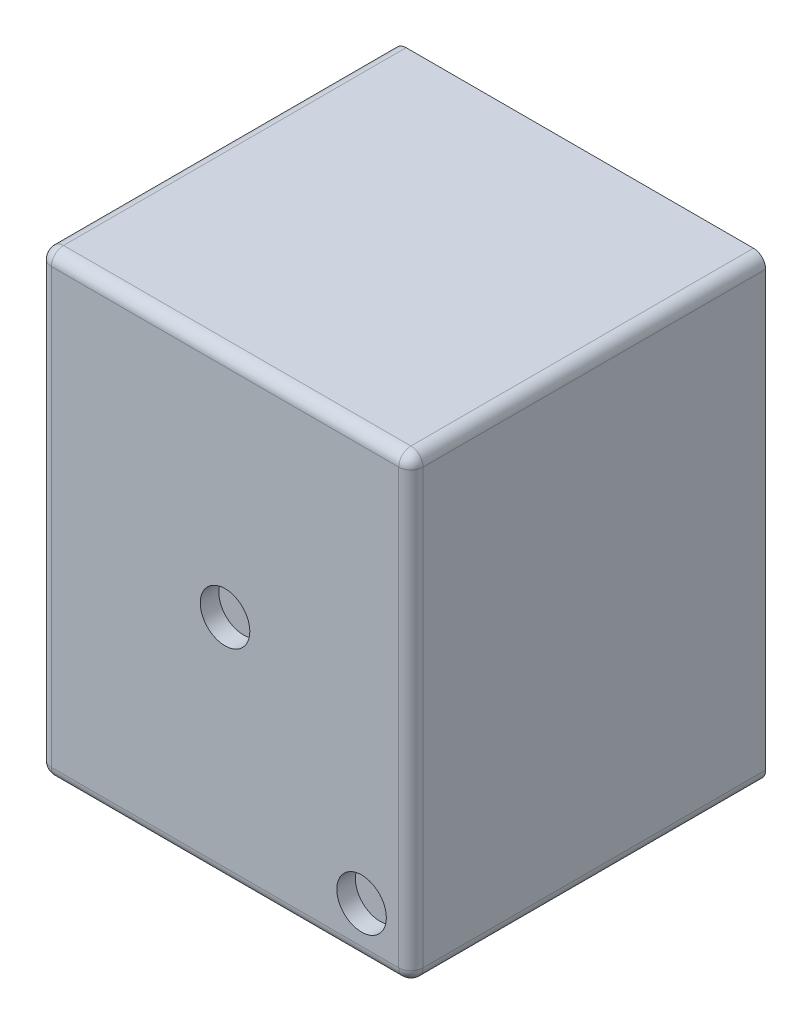
ISO-10303-21;
HEADER;
FILE_DESCRIPTION(('STEP AP214'),'2;1');
FILE_NAME('part.step','',(''),(''),'','','');
FILE_SCHEMA(('AUTOMOTIVE_DESIGN { 1 0 10303 214 1 1 1 1 }'));
ENDSEC;
DATA;
#1=APPLICATION_CONTEXT('core data for automotive mechanical design processes');
#2=APPLICATION_PROTOCOL_DEFINITION('international standard','automotive_design',2000,#1);
#3=PRODUCT_CONTEXT('',#1,'mechanical');
#4=PRODUCT('Part','Part','',(#3));
#5=PRODUCT_RELATED_PRODUCT_CATEGORY('part','',(#4));
#6=PRODUCT_DEFINITION_FORMATION('','',#4);
#7=PRODUCT_DEFINITION_CONTEXT('part definition',#1,'design');
#8=PRODUCT_DEFINITION('design','',#6,#7);
#9=PRODUCT_DEFINITION_SHAPE('','',#8);
#10=(LENGTH_UNIT() NAMED_UNIT(*) SI_UNIT(.MILLI.,.METRE.));
#11=(NAMED_UNIT(*) PLANE_ANGLE_UNIT() SI_UNIT($,.RADIAN.));
#12=(NAMED_UNIT(*) SI_UNIT($,.STERADIAN.) SOLID_ANGLE_UNIT());
#13=UNCERTAINTY_MEASURE_WITH_UNIT(LENGTH_MEASURE(1.E-05),#10,'distance_accuracy_value','');
#14=(GEOMETRIC_REPRESENTATION_CONTEXT(3) GLOBAL_UNCERTAINTY_ASSIGNED_CONTEXT((#13)) GLOBAL_UNIT_ASSIGNED_CONTEXT((#10,
#11,#12)) REPRESENTATION_CONTEXT('',''));
#15=CARTESIAN_POINT('',(0.,0.,0.));
#16=DIRECTION('',(0.,0.,1.));
#17=DIRECTION('',(1.,0.,0.));
#18=AXIS2_PLACEMENT_3D('',#15,#16,#17);
#19=CARTESIAN_POINT('',(-0.322364285309383,0.168780356945077,0.617807641667743));
#20=DIRECTION('',(0.,0.,1.));
#21=DIRECTION('',(1.,0.,0.));
#22=AXIS2_PLACEMENT_3D('',#19,#20,#21);
#23=PLANE('',#22);
#24=CARTESIAN_POINT('',(-0.322364285309383,0.168780356945077,0.617807641667743));
#25=DIRECTION('',(0.,0.,1.));
#26=DIRECTION('',(1.,0.,0.));
#27=AXIS2_PLACEMENT_3D('',#24,#25,#26);
#28=CIRCLE('',#27,0.04);
#29=CARTESIAN_POINT('',(-0.282364285309383,0.168780356945077,0.617807641667743));
#30=VERTEX_POINT('',#29);
#31=EDGE_CURVE('E20',#30,#30,#28,.T.);
#32=ORIENTED_EDGE('',*,*,#31,.T.);
#33=EDGE_LOOP('',(#32));
#34=FACE_BOUND('',#33,.T.);
#35=ADVANCED_FACE('F17',(#34),#23,.T.);
#36=CARTESIAN_POINT('',(-0.101920242454084,-0.121368087614107,0.617807641667743));
#37=DIRECTION('',(0.,0.,1.));
#38=DIRECTION('',(1.,0.,0.));
#39=AXIS2_PLACEMENT_3D('',#36,#37,#38);
#40=PLANE('',#39);
#41=CARTESIAN_POINT('',(-0.101920242454084,-0.121368087614107,0.617807641667743));
#42=DIRECTION('',(0.,0.,1.));
#43=DIRECTION('',(1.,0.,0.));
#44=AXIS2_PLACEMENT_3D('',#41,#42,#43);
#45=CIRCLE('',#44,0.04);
#46=CARTESIAN_POINT('',(-0.061920242454084,-0.121368087614107,0.617807641667743));
#47=VERTEX_POINT('',#46);
#48=EDGE_CURVE('E175',#47,#47,#45,.T.);
#49=ORIENTED_EDGE('',*,*,#48,.T.);
#50=EDGE_LOOP('',(#49));
#51=FACE_BOUND('',#50,.T.);
#52=ADVANCED_FACE('F187',(#51),#40,.T.);
#53=CARTESIAN_POINT('',(-0.322364285309383,0.168780356945077,0.647807641667743));
#54=DIRECTION('',(0.,0.,1.));
#55=DIRECTION('',(1.,0.,0.));
#56=AXIS2_PLACEMENT_3D('',#53,#54,#55);
#57=CYLINDRICAL_SURFACE('',#56,0.04);
#58=ORIENTED_EDGE('',*,*,#31,.F.);
#59=EDGE_LOOP('',(#58));
#60=FACE_BOUND('',#59,.T.);
#61=CARTESIAN_POINT('',(-0.322364285309383,0.168780356945077,0.647807641667743));
#62=DIRECTION('',(0.,0.,1.));
#63=DIRECTION('',(1.,0.,0.));
#64=AXIS2_PLACEMENT_3D('',#61,#62,#63);
#65=CIRCLE('',#64,0.04);
#66=CARTESIAN_POINT('',(-0.282364285309383,0.168780356945077,0.647807641667743));
#67=VERTEX_POINT('',#66);
#68=EDGE_CURVE('E173',#67,#67,#65,.T.);
#69=ORIENTED_EDGE('',*,*,#68,.T.);
#70=EDGE_LOOP('',(#69));
#71=FACE_BOUND('',#70,.T.);
#72=ADVANCED_FACE('F183',(#60,#71),#57,.F.);
#73=CARTESIAN_POINT('',(-0.101920242454084,-0.121368087614107,0.647807641667743));
#74=DIRECTION('',(0.,0.,1.));
#75=DIRECTION('',(1.,0.,0.));
#76=AXIS2_PLACEMENT_3D('',#73,#74,#75);
#77=CYLINDRICAL_SURFACE('',#76,0.04);
#78=ORIENTED_EDGE('',*,*,#48,.F.);
#79=EDGE_LOOP('',(#78));
#80=FACE_BOUND('',#79,.T.);
#81=CARTESIAN_POINT('',(-0.101920242454084,-0.121368087614107,0.647807641667743));
#82=DIRECTION('',(0.,0.,1.));
#83=DIRECTION('',(1.,0.,0.));
#84=AXIS2_PLACEMENT_3D('',#81,#82,#83);
#85=CIRCLE('',#84,0.04);
#86=CARTESIAN_POINT('',(-0.061920242454084,-0.121368087614107,0.647807641667743));
#87=VERTEX_POINT('',#86);
#88=EDGE_CURVE('E139',#87,#87,#85,.T.);
#89=ORIENTED_EDGE('',*,*,#88,.T.);
#90=EDGE_LOOP('',(#89));
#91=FACE_BOUND('',#90,.T.);
#92=ADVANCED_FACE('F186',(#80,#91),#77,.F.);
#93=CARTESIAN_POINT('',(-0.630852732450211,0.55394364596018,0.647807641667743));
#94=DIRECTION('',(0.,0.,-1.));
#95=DIRECTION('',(-1.,0.,0.));
#96=AXIS2_PLACEMENT_3D('',#93,#94,#95);
#97=PLANE('',#96);
#98=DIRECTION('',(0.,-1.,0.));
#99=VECTOR('',#98,1.);
#100=CARTESIAN_POINT('',(-0.041920242454084,-0.216382932070025,0.647807641667743));
#101=LINE('',#100,#99);
#102=CARTESIAN_POINT('',(-0.0419202424540837,0.518928801504261,0.647807641667743));
#103=VERTEX_POINT('',#102);
#104=CARTESIAN_POINT('',(-0.0419202424540841,-0.181368087614107,0.647807641667743));
#105=VERTEX_POINT('',#104);
#106=EDGE_CURVE('E132',#103,#105,#101,.T.);
#107=ORIENTED_EDGE('',*,*,#106,.F.);
#108=DIRECTION('',(1.,0.,0.));
#109=VECTOR('',#108,1.);
#110=CARTESIAN_POINT('',(-0.0138758381685538,0.518928801504262,0.647807641667743));
#111=LINE('',#110,#109);
#112=CARTESIAN_POINT('',(-0.602808328164682,0.518928801504262,0.647807641667743));
#113=VERTEX_POINT('',#112);
#114=EDGE_CURVE('E126',#113,#103,#111,.T.);
#115=ORIENTED_EDGE('',*,*,#114,.F.);
#116=DIRECTION('',(0.,1.,0.));
#117=VECTOR('',#116,1.);
#118=CARTESIAN_POINT('',(-0.602808328164682,0.55394364596018,0.647807641667743));
#119=LINE('',#118,#117);
#120=CARTESIAN_POINT('',(-0.602808328164682,-0.181368087614107,0.647807641667743));
#121=VERTEX_POINT('',#120);
#122=EDGE_CURVE('E155',#121,#113,#119,.T.);
#123=ORIENTED_EDGE('',*,*,#122,.F.);
#124=DIRECTION('',(-1.,0.,0.));
#125=VECTOR('',#124,1.);
#126=CARTESIAN_POINT('',(-0.630852732450212,-0.181368087614107,0.647807641667743));
#127=LINE('',#126,#125);
#128=EDGE_CURVE('E131',#105,#121,#127,.T.);
#129=ORIENTED_EDGE('',*,*,#128,.F.);
#130=EDGE_LOOP('',(#107,#115,#123,#129));
#131=FACE_BOUND('',#130,.T.);
#132=ORIENTED_EDGE('',*,*,#88,.F.);
#133=EDGE_LOOP('',(#132));
#134=FACE_BOUND('',#133,.T.);
#135=ORIENTED_EDGE('',*,*,#68,.F.);
#136=EDGE_LOOP('',(#135));
#137=FACE_BOUND('',#136,.T.);
#138=ADVANCED_FACE('F135',(#131,#134,#137),#97,.F.);
#139=CARTESIAN_POINT('',(-0.630852732450212,-0.181368087614107,0.628135510520202));
#140=DIRECTION('',(-1.,0.,0.));
#141=DIRECTION('',(0.,-1.,0.));
#142=AXIS2_PLACEMENT_3D('',#139,#140,#141);
#143=CYLINDRICAL_SURFACE('',#142,0.019672131147541);
#144=DIRECTION('',(1.,0.,0.));
#145=VECTOR('',#144,1.);
#146=CARTESIAN_POINT('',(-0.622480459312222,-0.201040218761648,0.628135510520202));
#147=LINE('',#146,#145);
#148=CARTESIAN_POINT('',(-0.0419202424540841,-0.201040218761648,0.628135510520202));
#149=VERTEX_POINT('',#148);
#150=CARTESIAN_POINT('',(-0.602808328164683,-0.201040218761648,0.628135510520202));
#151=VERTEX_POINT('',#150);
#152=EDGE_CURVE('E293',#149,#151,#147,.F.);
#153=ORIENTED_EDGE('',*,*,#152,.F.);
#154=CARTESIAN_POINT('',(-0.0419202424540841,-0.181368087614107,0.628135510520202));
#155=DIRECTION('',(-1.,0.,0.));
#156=DIRECTION('',(0.,-1.,0.));
#157=AXIS2_PLACEMENT_3D('',#154,#155,#156);
#158=CIRCLE('',#157,0.019672131147541);
#159=EDGE_CURVE('E147',#105,#149,#158,.F.);
#160=ORIENTED_EDGE('',*,*,#159,.F.);
#161=ORIENTED_EDGE('',*,*,#128,.T.);
#162=CARTESIAN_POINT('',(-0.602808328164683,-0.181368087614107,0.628135510520202));
#163=DIRECTION('',(-1.,0.,0.));
#164=DIRECTION('',(0.,-1.,0.));
#165=AXIS2_PLACEMENT_3D('',#162,#163,#164);
#166=CIRCLE('',#165,0.019672131147541);
#167=EDGE_CURVE('E260',#151,#121,#166,.T.);
#168=ORIENTED_EDGE('',*,*,#167,.F.);
#169=EDGE_LOOP('',(#153,#160,#161,#168));
#170=FACE_BOUND('',#169,.T.);
#171=ADVANCED_FACE('F192',(#170),#143,.T.);
#172=CARTESIAN_POINT('',(-0.0419202424540841,-0.181368087614107,0.628135510520202));
#173=DIRECTION('',(0.,-1.,0.));
#174=DIRECTION('',(0.,0.,1.));
#175=AXIS2_PLACEMENT_3D('',#172,#173,#174);
#176=SPHERICAL_SURFACE('',#175,0.019672131147541);
#177=CARTESIAN_POINT('',(-0.0419202424540841,-0.181368087614107,0.628135510520202));
#178=DIRECTION('',(0.,-1.,0.));
#179=DIRECTION('',(1.,0.,0.));
#180=AXIS2_PLACEMENT_3D('',#177,#178,#179);
#181=CIRCLE('',#180,0.019672131147541);
#182=CARTESIAN_POINT('',(-0.0222481113065434,-0.181368087614107,0.628135510520202));
#183=VERTEX_POINT('',#182);
#184=EDGE_CURVE('E106',#105,#183,#181,.F.);
#185=ORIENTED_EDGE('',*,*,#184,.F.);
#186=ORIENTED_EDGE('',*,*,#159,.T.);
#187=CARTESIAN_POINT('',(-0.0419202424540841,-0.181368087614107,0.628135510520202));
#188=DIRECTION('',(0.,0.,-1.));
#189=DIRECTION('',(-1.,0.,0.));
#190=AXIS2_PLACEMENT_3D('',#187,#188,#189);
#191=CIRCLE('',#190,0.019672131147541);
#192=EDGE_CURVE('E283',#183,#149,#191,.T.);
#193=ORIENTED_EDGE('',*,*,#192,.F.);
#194=EDGE_LOOP('',(#185,#186,#193));
#195=FACE_BOUND('',#194,.T.);
#196=ADVANCED_FACE('F199',(#195),#176,.T.);
#197=CARTESIAN_POINT('',(-0.0419202424540841,-0.216382932070025,0.628135510520202));
#198=DIRECTION('',(0.,-1.,0.));
#199=DIRECTION('',(1.,0.,0.));
#200=AXIS2_PLACEMENT_3D('',#197,#198,#199);
#201=CYLINDRICAL_SURFACE('',#200,0.019672131147541);
#202=DIRECTION('',(0.,1.,0.));
#203=VECTOR('',#202,1.);
#204=CARTESIAN_POINT('',(-0.0222481113065438,-0.201040218761648,0.628135510520202));
#205=LINE('',#204,#203);
#206=CARTESIAN_POINT('',(-0.0222481113065429,0.518928801504261,0.628135510520202));
#207=VERTEX_POINT('',#206);
#208=EDGE_CURVE('E144',#207,#183,#205,.F.);
#209=ORIENTED_EDGE('',*,*,#208,.F.);
#210=CARTESIAN_POINT('',(-0.0419202424540837,0.518928801504261,0.628135510520202));
#211=DIRECTION('',(0.,-1.,0.));
#212=DIRECTION('',(0.,0.,1.));
#213=AXIS2_PLACEMENT_3D('',#210,#211,#212);
#214=CIRCLE('',#213,0.0196721311475411);
#215=EDGE_CURVE('E115',#103,#207,#214,.F.);
#216=ORIENTED_EDGE('',*,*,#215,.F.);
#217=ORIENTED_EDGE('',*,*,#106,.T.);
#218=ORIENTED_EDGE('',*,*,#184,.T.);
#219=EDGE_LOOP('',(#209,#216,#217,#218));
#220=FACE_BOUND('',#219,.T.);
#221=ADVANCED_FACE('F142',(#220),#201,.T.);
#222=CARTESIAN_POINT('',(-0.0419202424540837,0.518928801504261,0.628135510520202));
#223=DIRECTION('',(0.,-1.,0.));
#224=DIRECTION('',(0.,0.,1.));
#225=AXIS2_PLACEMENT_3D('',#222,#223,#224);
#226=SPHERICAL_SURFACE('',#225,0.019672131147541);
#227=CARTESIAN_POINT('',(-0.0419202424540836,0.518928801504261,0.628135510520202));
#228=DIRECTION('',(1.,0.,0.));
#229=DIRECTION('',(0.,1.,0.));
#230=AXIS2_PLACEMENT_3D('',#227,#228,#229);
#231=CIRCLE('',#230,0.019672131147541);
#232=CARTESIAN_POINT('',(-0.0419202424540837,0.538600932651802,0.628135510520202));
#233=VERTEX_POINT('',#232);
#234=EDGE_CURVE('E111',#103,#233,#231,.F.);
#235=ORIENTED_EDGE('',*,*,#234,.F.);
#236=ORIENTED_EDGE('',*,*,#215,.T.);
#237=CARTESIAN_POINT('',(-0.0419202424540837,0.518928801504261,0.628135510520202));
#238=DIRECTION('',(0.,0.,-1.));
#239=DIRECTION('',(-1.,0.,0.));
#240=AXIS2_PLACEMENT_3D('',#237,#238,#239);
#241=CIRCLE('',#240,0.019672131147541);
#242=EDGE_CURVE('E117',#233,#207,#241,.T.);
#243=ORIENTED_EDGE('',*,*,#242,.F.);
#244=EDGE_LOOP('',(#235,#236,#243));
#245=FACE_BOUND('',#244,.T.);
#246=ADVANCED_FACE('F113',(#245),#226,.T.);
#247=CARTESIAN_POINT('',(-0.0138758381685538,0.518928801504261,0.628135510520202));
#248=DIRECTION('',(1.,0.,0.));
#249=DIRECTION('',(0.,1.,0.));
#250=AXIS2_PLACEMENT_3D('',#247,#248,#249);
#251=CYLINDRICAL_SURFACE('',#250,0.019672131147541);
#252=DIRECTION('',(-1.,0.,0.));
#253=VECTOR('',#252,1.);
#254=CARTESIAN_POINT('',(-0.0222481113065438,0.538600932651802,0.628135510520202));
#255=LINE('',#254,#253);
#256=CARTESIAN_POINT('',(-0.602808328164682,0.538600932651803,0.628135510520202));
#257=VERTEX_POINT('',#256);
#258=EDGE_CURVE('E265',#257,#233,#255,.F.);
#259=ORIENTED_EDGE('',*,*,#258,.F.);
#260=CARTESIAN_POINT('',(-0.602808328164682,0.518928801504262,0.628135510520202));
#261=DIRECTION('',(-1.,0.,0.));
#262=DIRECTION('',(0.,-1.,0.));
#263=AXIS2_PLACEMENT_3D('',#260,#261,#262);
#264=CIRCLE('',#263,0.019672131147541);
#265=EDGE_CURVE('E122',#113,#257,#264,.T.);
#266=ORIENTED_EDGE('',*,*,#265,.F.);
#267=ORIENTED_EDGE('',*,*,#114,.T.);
#268=ORIENTED_EDGE('',*,*,#234,.T.);
#269=EDGE_LOOP('',(#259,#266,#267,#268));
#270=FACE_BOUND('',#269,.T.);
#271=ADVANCED_FACE('F128',(#270),#251,.T.);
#272=CARTESIAN_POINT('',(-0.602808328164682,0.518928801504262,0.628135510520202));
#273=DIRECTION('',(0.,-1.,0.));
#274=DIRECTION('',(0.,0.,1.));
#275=AXIS2_PLACEMENT_3D('',#272,#273,#274);
#276=SPHERICAL_SURFACE('',#275,0.019672131147541);
#277=CARTESIAN_POINT('',(-0.602808328164682,0.518928801504262,0.628135510520202));
#278=DIRECTION('',(0.,1.,0.));
#279=DIRECTION('',(-1.,0.,0.));
#280=AXIS2_PLACEMENT_3D('',#277,#278,#279);
#281=CIRCLE('',#280,0.019672131147541);
#282=CARTESIAN_POINT('',(-0.622480459312223,0.518928801504262,0.628135510520202));
#283=VERTEX_POINT('',#282);
#284=EDGE_CURVE('E258',#113,#283,#281,.F.);
#285=ORIENTED_EDGE('',*,*,#284,.F.);
#286=ORIENTED_EDGE('',*,*,#265,.T.);
#287=CARTESIAN_POINT('',(-0.602808328164682,0.518928801504262,0.628135510520202));
#288=DIRECTION('',(0.,0.,-1.));
#289=DIRECTION('',(-1.,0.,0.));
#290=AXIS2_PLACEMENT_3D('',#287,#288,#289);
#291=CIRCLE('',#290,0.019672131147541);
#292=EDGE_CURVE('E251',#283,#257,#291,.T.);
#293=ORIENTED_EDGE('',*,*,#292,.F.);
#294=EDGE_LOOP('',(#285,#286,#293));
#295=FACE_BOUND('',#294,.T.);
#296=ADVANCED_FACE('F267',(#295),#276,.T.);
#297=CARTESIAN_POINT('',(-0.602808328164682,0.55394364596018,0.628135510520202));
#298=DIRECTION('',(0.,1.,0.));
#299=DIRECTION('',(-1.,0.,0.));
#300=AXIS2_PLACEMENT_3D('',#297,#298,#299);
#301=CYLINDRICAL_SURFACE('',#300,0.019672131147541);
#302=DIRECTION('',(0.,-1.,0.));
#303=VECTOR('',#302,1.);
#304=CARTESIAN_POINT('',(-0.622480459312222,0.538600932651803,0.628135510520202));
#305=LINE('',#304,#303);
#306=CARTESIAN_POINT('',(-0.622480459312224,-0.181368087614107,0.628135510520202));
#307=VERTEX_POINT('',#306);
#308=EDGE_CURVE('E254',#307,#283,#305,.F.);
#309=ORIENTED_EDGE('',*,*,#308,.F.);
#310=CARTESIAN_POINT('',(-0.602808328164683,-0.181368087614107,0.628135510520202));
#311=DIRECTION('',(0.,-1.,0.));
#312=DIRECTION('',(0.,0.,1.));
#313=AXIS2_PLACEMENT_3D('',#310,#311,#312);
#314=CIRCLE('',#313,0.0196721311475411);
#315=EDGE_CURVE('E75',#121,#307,#314,.T.);
#316=ORIENTED_EDGE('',*,*,#315,.F.);
#317=ORIENTED_EDGE('',*,*,#122,.T.);
#318=ORIENTED_EDGE('',*,*,#284,.T.);
#319=EDGE_LOOP('',(#309,#316,#317,#318));
#320=FACE_BOUND('',#319,.T.);
#321=ADVANCED_FACE('F244',(#320),#301,.T.);
#322=CARTESIAN_POINT('',(-0.602808328164683,-0.181368087614107,0.628135510520202));
#323=DIRECTION('',(0.,-1.,0.));
#324=DIRECTION('',(0.,0.,1.));
#325=AXIS2_PLACEMENT_3D('',#322,#323,#324);
#326=SPHERICAL_SURFACE('',#325,0.019672131147541);
#327=ORIENTED_EDGE('',*,*,#167,.T.);
#328=ORIENTED_EDGE('',*,*,#315,.T.);
#329=CARTESIAN_POINT('',(-0.602808328164683,-0.181368087614107,0.628135510520202));
#330=DIRECTION('',(0.,0.,-1.));
#331=DIRECTION('',(-1.,0.,0.));
#332=AXIS2_PLACEMENT_3D('',#329,#330,#331);
#333=CIRCLE('',#332,0.019672131147541);
#334=EDGE_CURVE('E515',#151,#307,#333,.T.);
#335=ORIENTED_EDGE('',*,*,#334,.F.);
#336=EDGE_LOOP('',(#327,#328,#335));
#337=FACE_BOUND('',#336,.T.);
#338=ADVANCED_FACE('F240',(#337),#326,.T.);
#339=CARTESIAN_POINT('',(-0.622480459312222,-0.201040218761648,0.0553202271847168));
#340=DIRECTION('',(0.,-1.,0.));
#341=DIRECTION('',(1.,0.,0.));
#342=AXIS2_PLACEMENT_3D('',#339,#340,#341);
#343=PLANE('',#342);
#344=DIRECTION('',(0.,0.,1.));
#345=VECTOR('',#344,1.);
#346=CARTESIAN_POINT('',(-0.602808328164683,-0.201040218761648,0.0553202271847168));
#347=LINE('',#346,#345);
#348=CARTESIAN_POINT('',(-0.602808328164683,-0.201040218761648,0.0749923583322578));
#349=VERTEX_POINT('',#348);
#350=EDGE_CURVE('E67',#151,#349,#347,.F.);
#351=ORIENTED_EDGE('',*,*,#350,.T.);
#352=DIRECTION('',(1.,0.,0.));
#353=VECTOR('',#352,1.);
#354=CARTESIAN_POINT('',(-0.322364285309383,-0.201040218761648,0.0749923583322578));
#355=LINE('',#354,#353);
#356=CARTESIAN_POINT('',(-0.0419202424540841,-0.201040218761648,0.0749923583322578));
#357=VERTEX_POINT('',#356);
#358=EDGE_CURVE('E168',#349,#357,#355,.T.);
#359=ORIENTED_EDGE('',*,*,#358,.T.);
#360=DIRECTION('',(0.,0.,-1.));
#361=VECTOR('',#360,1.);
#362=CARTESIAN_POINT('',(-0.0419202424540841,-0.201040218761648,0.0553202271847168));
#363=LINE('',#362,#361);
#364=EDGE_CURVE('E59',#149,#357,#363,.T.);
#365=ORIENTED_EDGE('',*,*,#364,.F.);
#366=ORIENTED_EDGE('',*,*,#152,.T.);
#367=EDGE_LOOP('',(#351,#359,#365,#366));
#368=FACE_BOUND('',#367,.T.);
#369=ADVANCED_FACE('F237',(#368),#343,.T.);
#370=CARTESIAN_POINT('',(-0.0419202424540841,-0.181368087614107,0.0553202271847168));
#371=DIRECTION('',(0.,0.,-1.));
#372=DIRECTION('',(-1.,0.,0.));
#373=AXIS2_PLACEMENT_3D('',#370,#371,#372);
#374=CYLINDRICAL_SURFACE('',#373,0.019672131147541);
#375=DIRECTION('',(0.,0.,1.));
#376=VECTOR('',#375,1.);
#377=CARTESIAN_POINT('',(-0.0222481113065438,-0.181368087614107,0.0553202271847168));
#378=LINE('',#377,#376);
#379=CARTESIAN_POINT('',(-0.0222481113065438,-0.181368087614107,0.0749923583322578));
#380=VERTEX_POINT('',#379);
#381=EDGE_CURVE('E282',#183,#380,#378,.F.);
#382=ORIENTED_EDGE('',*,*,#381,.F.);
#383=ORIENTED_EDGE('',*,*,#192,.T.);
#384=ORIENTED_EDGE('',*,*,#364,.T.);
#385=CARTESIAN_POINT('',(-0.0419202424540841,-0.181368087614107,0.0749923583322578));
#386=DIRECTION('',(0.,0.,-1.));
#387=DIRECTION('',(-1.,0.,0.));
#388=AXIS2_PLACEMENT_3D('',#385,#386,#387);
#389=CIRCLE('',#388,0.019672131147541);
#390=EDGE_CURVE('E166',#357,#380,#389,.F.);
#391=ORIENTED_EDGE('',*,*,#390,.T.);
#392=EDGE_LOOP('',(#382,#383,#384,#391));
#393=FACE_BOUND('',#392,.T.);
#394=ADVANCED_FACE('F233',(#393),#374,.T.);
#395=CARTESIAN_POINT('',(-0.0222481113065438,-0.201040218761648,0.0553202271847168));
#396=DIRECTION('',(1.,0.,0.));
#397=DIRECTION('',(0.,1.,0.));
#398=AXIS2_PLACEMENT_3D('',#395,#396,#397);
#399=PLANE('',#398);
#400=ORIENTED_EDGE('',*,*,#208,.T.);
#401=ORIENTED_EDGE('',*,*,#381,.T.);
#402=DIRECTION('',(0.,1.,0.));
#403=VECTOR('',#402,1.);
#404=CARTESIAN_POINT('',(-0.0222481113065438,0.168780356945077,0.0749923583322578));
#405=LINE('',#404,#403);
#406=CARTESIAN_POINT('',(-0.0222481113065432,0.518928801504261,0.0749923583322578));
#407=VERTEX_POINT('',#406);
#408=EDGE_CURVE('E165',#380,#407,#405,.T.);
#409=ORIENTED_EDGE('',*,*,#408,.T.);
#410=DIRECTION('',(0.,0.,-1.));
#411=VECTOR('',#410,1.);
#412=CARTESIAN_POINT('',(-0.0222481113065427,0.518928801504261,0.0553202271847168));
#413=LINE('',#412,#411);
#414=EDGE_CURVE('E533',#207,#407,#413,.T.);
#415=ORIENTED_EDGE('',*,*,#414,.F.);
#416=EDGE_LOOP('',(#400,#401,#409,#415));
#417=FACE_BOUND('',#416,.T.);
#418=ADVANCED_FACE('F229',(#417),#399,.T.);
#419=CARTESIAN_POINT('',(-0.0419202424540837,0.518928801504261,0.0553202271847168));
#420=DIRECTION('',(0.,0.,-1.));
#421=DIRECTION('',(-1.,0.,0.));
#422=AXIS2_PLACEMENT_3D('',#419,#420,#421);
#423=CYLINDRICAL_SURFACE('',#422,0.019672131147541);
#424=DIRECTION('',(0.,0.,1.));
#425=VECTOR('',#424,1.);
#426=CARTESIAN_POINT('',(-0.0419202424540837,0.538600932651802,0.0553202271847168));
#427=LINE('',#426,#425);
#428=CARTESIAN_POINT('',(-0.0419202424540837,0.538600932651802,0.0749923583322578));
#429=VERTEX_POINT('',#428);
#430=EDGE_CURVE('E526',#233,#429,#427,.F.);
#431=ORIENTED_EDGE('',*,*,#430,.F.);
#432=ORIENTED_EDGE('',*,*,#242,.T.);
#433=ORIENTED_EDGE('',*,*,#414,.T.);
#434=CARTESIAN_POINT('',(-0.0419202424540837,0.518928801504261,0.0749923583322578));
#435=DIRECTION('',(0.,0.,-1.));
#436=DIRECTION('',(-1.,0.,0.));
#437=AXIS2_PLACEMENT_3D('',#434,#435,#436);
#438=CIRCLE('',#437,0.019672131147541);
#439=EDGE_CURVE('E163',#407,#429,#438,.F.);
#440=ORIENTED_EDGE('',*,*,#439,.T.);
#441=EDGE_LOOP('',(#431,#432,#433,#440));
#442=FACE_BOUND('',#441,.T.);
#443=ADVANCED_FACE('F225',(#442),#423,.T.);
#444=CARTESIAN_POINT('',(-0.0222481113065438,0.538600932651802,0.0553202271847168));
#445=DIRECTION('',(0.,1.,0.));
#446=DIRECTION('',(-1.,0.,0.));
#447=AXIS2_PLACEMENT_3D('',#444,#445,#446);
#448=PLANE('',#447);
#449=ORIENTED_EDGE('',*,*,#258,.T.);
#450=ORIENTED_EDGE('',*,*,#430,.T.);
#451=DIRECTION('',(1.,0.,0.));
#452=VECTOR('',#451,1.);
#453=CARTESIAN_POINT('',(-0.322364285309383,0.538600932651802,0.0749923583322578));
#454=LINE('',#453,#452);
#455=CARTESIAN_POINT('',(-0.602808328164682,0.538600932651803,0.0749923583322578));
#456=VERTEX_POINT('',#455);
#457=EDGE_CURVE('E162',#429,#456,#454,.F.);
#458=ORIENTED_EDGE('',*,*,#457,.T.);
#459=DIRECTION('',(0.,0.,-1.));
#460=VECTOR('',#459,1.);
#461=CARTESIAN_POINT('',(-0.602808328164682,0.538600932651803,0.0553202271847168));
#462=LINE('',#461,#460);
#463=EDGE_CURVE('E255',#257,#456,#462,.T.);
#464=ORIENTED_EDGE('',*,*,#463,.F.);
#465=EDGE_LOOP('',(#449,#450,#458,#464));
#466=FACE_BOUND('',#465,.T.);
#467=ADVANCED_FACE('F221',(#466),#448,.T.);
#468=CARTESIAN_POINT('',(-0.602808328164682,0.518928801504262,0.0553202271847168));
#469=DIRECTION('',(0.,0.,-1.));
#470=DIRECTION('',(-1.,0.,0.));
#471=AXIS2_PLACEMENT_3D('',#468,#469,#470);
#472=CYLINDRICAL_SURFACE('',#471,0.019672131147541);
#473=DIRECTION('',(0.,0.,1.));
#474=VECTOR('',#473,1.);
#475=CARTESIAN_POINT('',(-0.622480459312222,0.518928801504262,0.0553202271847168));
#476=LINE('',#475,#474);
#477=CARTESIAN_POINT('',(-0.622480459312222,0.518928801504262,0.0749923583322578));
#478=VERTEX_POINT('',#477);
#479=EDGE_CURVE('E513',#283,#478,#476,.F.);
#480=ORIENTED_EDGE('',*,*,#479,.F.);
#481=ORIENTED_EDGE('',*,*,#292,.T.);
#482=ORIENTED_EDGE('',*,*,#463,.T.);
#483=CARTESIAN_POINT('',(-0.602808328164682,0.518928801504262,0.0749923583322578));
#484=DIRECTION('',(0.,0.,-1.));
#485=DIRECTION('',(-1.,0.,0.));
#486=AXIS2_PLACEMENT_3D('',#483,#484,#485);
#487=CIRCLE('',#486,0.019672131147541);
#488=EDGE_CURVE('E26',#456,#478,#487,.F.);
#489=ORIENTED_EDGE('',*,*,#488,.T.);
#490=EDGE_LOOP('',(#480,#481,#482,#489));
#491=FACE_BOUND('',#490,.T.);
#492=ADVANCED_FACE('F217',(#491),#472,.T.);
#493=CARTESIAN_POINT('',(-0.622480459312222,0.538600932651803,0.0553202271847168));
#494=DIRECTION('',(-1.,0.,0.));
#495=DIRECTION('',(0.,-1.,0.));
#496=AXIS2_PLACEMENT_3D('',#493,#494,#495);
#497=PLANE('',#496);
#498=ORIENTED_EDGE('',*,*,#308,.T.);
#499=ORIENTED_EDGE('',*,*,#479,.T.);
#500=DIRECTION('',(0.,1.,0.));
#501=VECTOR('',#500,1.);
#502=CARTESIAN_POINT('',(-0.622480459312222,0.168780356945077,0.0749923583322578));
#503=LINE('',#502,#501);
#504=CARTESIAN_POINT('',(-0.622480459312223,-0.181368087614107,0.0749923583322578));
#505=VERTEX_POINT('',#504);
#506=EDGE_CURVE('E11',#478,#505,#503,.F.);
#507=ORIENTED_EDGE('',*,*,#506,.T.);
#508=DIRECTION('',(0.,0.,-1.));
#509=VECTOR('',#508,1.);
#510=CARTESIAN_POINT('',(-0.622480459312224,-0.181368087614107,0.0553202271847168));
#511=LINE('',#510,#509);
#512=EDGE_CURVE('E170',#307,#505,#511,.T.);
#513=ORIENTED_EDGE('',*,*,#512,.F.);
#514=EDGE_LOOP('',(#498,#499,#507,#513));
#515=FACE_BOUND('',#514,.T.);
#516=ADVANCED_FACE('F211',(#515),#497,.T.);
#517=CARTESIAN_POINT('',(-0.602808328164683,-0.181368087614107,0.0553202271847168));
#518=DIRECTION('',(0.,0.,-1.));
#519=DIRECTION('',(-1.,0.,0.));
#520=AXIS2_PLACEMENT_3D('',#517,#518,#519);
#521=CYLINDRICAL_SURFACE('',#520,0.019672131147541);
#522=ORIENTED_EDGE('',*,*,#512,.T.);
#523=CARTESIAN_POINT('',(-0.602808328164683,-0.181368087614107,0.0749923583322578));
#524=DIRECTION('',(0.,0.,-1.));
#525=DIRECTION('',(-1.,0.,0.));
#526=AXIS2_PLACEMENT_3D('',#523,#524,#525);
#527=CIRCLE('',#526,0.019672131147541);
#528=EDGE_CURVE('E35',#505,#349,#527,.F.);
#529=ORIENTED_EDGE('',*,*,#528,.T.);
#530=ORIENTED_EDGE('',*,*,#350,.F.);
#531=ORIENTED_EDGE('',*,*,#334,.T.);
#532=EDGE_LOOP('',(#522,#529,#530,#531));
#533=FACE_BOUND('',#532,.T.);
#534=ADVANCED_FACE('F206',(#533),#521,.T.);
#535=CARTESIAN_POINT('',(-0.322364285309383,0.168780356945077,0.0749923583322578));
#536=DIRECTION('',(0.,0.,1.));
#537=DIRECTION('',(1.,0.,0.));
#538=AXIS2_PLACEMENT_3D('',#535,#536,#537);
#539=PLANE('',#538);
#540=ORIENTED_EDGE('',*,*,#506,.F.);
#541=ORIENTED_EDGE('',*,*,#488,.F.);
#542=ORIENTED_EDGE('',*,*,#457,.F.);
#543=ORIENTED_EDGE('',*,*,#439,.F.);
#544=ORIENTED_EDGE('',*,*,#408,.F.);
#545=ORIENTED_EDGE('',*,*,#390,.F.);
#546=ORIENTED_EDGE('',*,*,#358,.F.);
#547=ORIENTED_EDGE('',*,*,#528,.F.);
#548=EDGE_LOOP('',(#540,#541,#542,#543,#544,#545,#546,#547));
#549=FACE_BOUND('',#548,.T.);
#550=ADVANCED_FACE('F204',(#549),#539,.F.);
#551=CLOSED_SHELL('',(#35,#52,#72,#92,#138,#171,#196,#221,#246,#271,#296,#321,#338,#369,#394,
#418,#443,#467,#492,#516,#534,#550));
#552=MANIFOLD_SOLID_BREP('B1',#551);
#553=ADVANCED_BREP_SHAPE_REPRESENTATION('',(#18,#552),#14);
#554=SHAPE_DEFINITION_REPRESENTATION(#9,#553);
ENDSEC;
END-ISO-10303-21;
